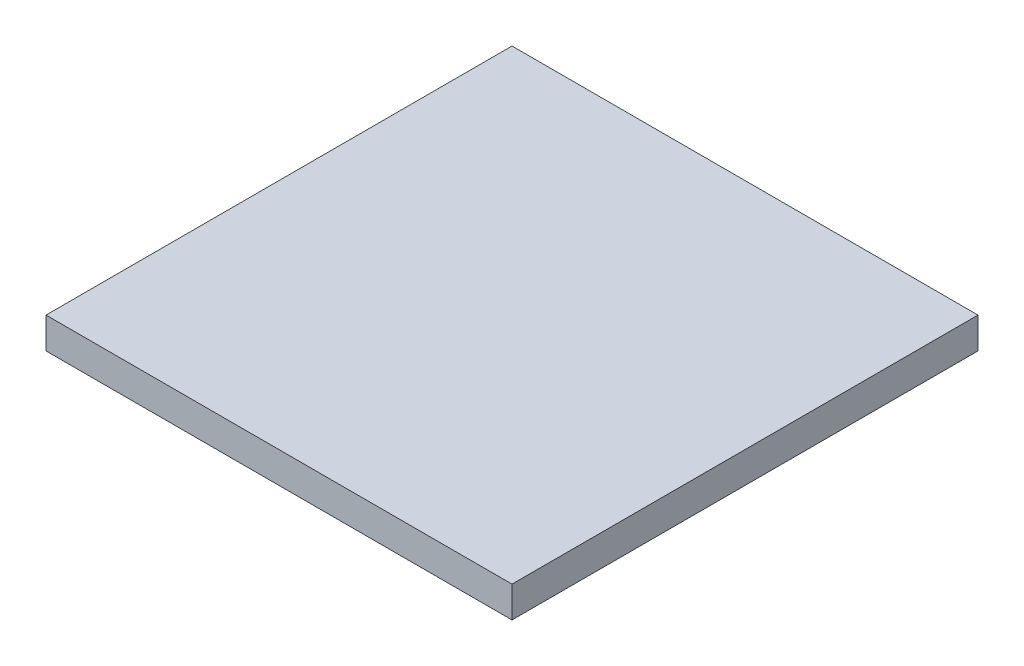
ISO-10303-21;
HEADER;
FILE_DESCRIPTION(('STEP AP214'),'2;1');
FILE_NAME('part.step','',(''),(''),'','','');
FILE_SCHEMA(('AUTOMOTIVE_DESIGN { 1 0 10303 214 1 1 1 1 }'));
ENDSEC;
DATA;
#1=APPLICATION_CONTEXT('core data for automotive mechanical design processes');
#2=APPLICATION_PROTOCOL_DEFINITION('international standard','automotive_design',2000,#1);
#3=PRODUCT_CONTEXT('',#1,'mechanical');
#4=PRODUCT('Part','Part','',(#3));
#5=PRODUCT_RELATED_PRODUCT_CATEGORY('part','',(#4));
#6=PRODUCT_DEFINITION_FORMATION('','',#4);
#7=PRODUCT_DEFINITION_CONTEXT('part definition',#1,'design');
#8=PRODUCT_DEFINITION('design','',#6,#7);
#9=PRODUCT_DEFINITION_SHAPE('','',#8);
#10=(LENGTH_UNIT() NAMED_UNIT(*) SI_UNIT(.MILLI.,.METRE.));
#11=(NAMED_UNIT(*) PLANE_ANGLE_UNIT() SI_UNIT($,.RADIAN.));
#12=(NAMED_UNIT(*) SI_UNIT($,.STERADIAN.) SOLID_ANGLE_UNIT());
#13=UNCERTAINTY_MEASURE_WITH_UNIT(LENGTH_MEASURE(1.E-05),#10,'distance_accuracy_value','');
#14=(GEOMETRIC_REPRESENTATION_CONTEXT(3) GLOBAL_UNCERTAINTY_ASSIGNED_CONTEXT((#13)) GLOBAL_UNIT_ASSIGNED_CONTEXT((#10,
#11,#12)) REPRESENTATION_CONTEXT('',''));
#15=CARTESIAN_POINT('',(0.,0.,0.));
#16=DIRECTION('',(0.,0.,1.));
#17=DIRECTION('',(1.,0.,0.));
#18=AXIS2_PLACEMENT_3D('',#15,#16,#17);
#19=CARTESIAN_POINT('',(0.,0.,0.));
#20=DIRECTION('',(0.,1.,0.));
#21=DIRECTION('',(0.,0.,1.));
#22=AXIS2_PLACEMENT_3D('',#19,#20,#21);
#23=PLANE('',#22);
#24=DIRECTION('',(-1.,0.,0.));
#25=VECTOR('',#24,1.);
#26=CARTESIAN_POINT('',(-7.5,0.,7.5));
#27=LINE('',#26,#25);
#28=CARTESIAN_POINT('',(7.5,0.,7.5));
#29=VERTEX_POINT('',#28);
#30=CARTESIAN_POINT('',(-7.5,0.,7.5));
#31=VERTEX_POINT('',#30);
#32=EDGE_CURVE('E81',#29,#31,#27,.T.);
#33=ORIENTED_EDGE('',*,*,#32,.T.);
#34=DIRECTION('',(0.,0.,-1.));
#35=VECTOR('',#34,1.);
#36=CARTESIAN_POINT('',(-7.5,0.,-7.5));
#37=LINE('',#36,#35);
#38=CARTESIAN_POINT('',(-7.5,0.,-7.5));
#39=VERTEX_POINT('',#38);
#40=EDGE_CURVE('E68',#31,#39,#37,.T.);
#41=ORIENTED_EDGE('',*,*,#40,.T.);
#42=DIRECTION('',(1.,0.,0.));
#43=VECTOR('',#42,1.);
#44=CARTESIAN_POINT('',(-7.5,0.,-7.5));
#45=LINE('',#44,#43);
#46=CARTESIAN_POINT('',(7.5,0.,-7.5));
#47=VERTEX_POINT('',#46);
#48=EDGE_CURVE('E55',#39,#47,#45,.T.);
#49=ORIENTED_EDGE('',*,*,#48,.T.);
#50=DIRECTION('',(0.,0.,1.));
#51=VECTOR('',#50,1.);
#52=CARTESIAN_POINT('',(7.5,0.,-7.5));
#53=LINE('',#52,#51);
#54=EDGE_CURVE('E20',#47,#29,#53,.T.);
#55=ORIENTED_EDGE('',*,*,#54,.T.);
#56=EDGE_LOOP('',(#33,#41,#49,#55));
#57=FACE_BOUND('',#56,.T.);
#58=ADVANCED_FACE('F17',(#57),#23,.F.);
#59=CARTESIAN_POINT('',(7.5,1.,-7.5));
#60=DIRECTION('',(-1.,0.,0.));
#61=DIRECTION('',(0.,0.,1.));
#62=AXIS2_PLACEMENT_3D('',#59,#60,#61);
#63=PLANE('',#62);
#64=DIRECTION('',(0.,1.,0.));
#65=VECTOR('',#64,1.);
#66=CARTESIAN_POINT('',(7.5,1.,-7.5));
#67=LINE('',#66,#65);
#68=CARTESIAN_POINT('',(7.5,1.,-7.5));
#69=VERTEX_POINT('',#68);
#70=EDGE_CURVE('E61',#47,#69,#67,.T.);
#71=ORIENTED_EDGE('',*,*,#70,.T.);
#72=DIRECTION('',(0.,0.,1.));
#73=VECTOR('',#72,1.);
#74=CARTESIAN_POINT('',(7.5,1.,0.));
#75=LINE('',#74,#73);
#76=CARTESIAN_POINT('',(7.5,1.,7.5));
#77=VERTEX_POINT('',#76);
#78=EDGE_CURVE('E83',#77,#69,#75,.F.);
#79=ORIENTED_EDGE('',*,*,#78,.F.);
#80=DIRECTION('',(0.,1.,0.));
#81=VECTOR('',#80,1.);
#82=CARTESIAN_POINT('',(7.5,1.,7.5));
#83=LINE('',#82,#81);
#84=EDGE_CURVE('E64',#77,#29,#83,.F.);
#85=ORIENTED_EDGE('',*,*,#84,.T.);
#86=ORIENTED_EDGE('',*,*,#54,.F.);
#87=EDGE_LOOP('',(#71,#79,#85,#86));
#88=FACE_BOUND('',#87,.T.);
#89=ADVANCED_FACE('F60',(#88),#63,.F.);
#90=CARTESIAN_POINT('',(-7.5,1.,-7.5));
#91=DIRECTION('',(0.,0.,1.));
#92=DIRECTION('',(1.,0.,0.));
#93=AXIS2_PLACEMENT_3D('',#90,#91,#92);
#94=PLANE('',#93);
#95=DIRECTION('',(0.,1.,0.));
#96=VECTOR('',#95,1.);
#97=CARTESIAN_POINT('',(-7.5,1.,-7.5));
#98=LINE('',#97,#96);
#99=CARTESIAN_POINT('',(-7.5,1.,-7.5));
#100=VERTEX_POINT('',#99);
#101=EDGE_CURVE('E70',#39,#100,#98,.T.);
#102=ORIENTED_EDGE('',*,*,#101,.T.);
#103=DIRECTION('',(1.,0.,0.));
#104=VECTOR('',#103,1.);
#105=CARTESIAN_POINT('',(0.,1.,-7.5));
#106=LINE('',#105,#104);
#107=EDGE_CURVE('E74',#69,#100,#106,.F.);
#108=ORIENTED_EDGE('',*,*,#107,.F.);
#109=ORIENTED_EDGE('',*,*,#70,.F.);
#110=ORIENTED_EDGE('',*,*,#48,.F.);
#111=EDGE_LOOP('',(#102,#108,#109,#110));
#112=FACE_BOUND('',#111,.T.);
#113=ADVANCED_FACE('F72',(#112),#94,.F.);
#114=CARTESIAN_POINT('',(-7.5,1.,-7.5));
#115=DIRECTION('',(1.,0.,0.));
#116=DIRECTION('',(0.,0.,-1.));
#117=AXIS2_PLACEMENT_3D('',#114,#115,#116);
#118=PLANE('',#117);
#119=DIRECTION('',(0.,1.,0.));
#120=VECTOR('',#119,1.);
#121=CARTESIAN_POINT('',(-7.5,1.,7.5));
#122=LINE('',#121,#120);
#123=CARTESIAN_POINT('',(-7.5,1.,7.5));
#124=VERTEX_POINT('',#123);
#125=EDGE_CURVE('E35',#31,#124,#122,.T.);
#126=ORIENTED_EDGE('',*,*,#125,.T.);
#127=DIRECTION('',(0.,0.,1.));
#128=VECTOR('',#127,1.);
#129=CARTESIAN_POINT('',(-7.5,1.,0.));
#130=LINE('',#129,#128);
#131=EDGE_CURVE('E26',#100,#124,#130,.T.);
#132=ORIENTED_EDGE('',*,*,#131,.F.);
#133=ORIENTED_EDGE('',*,*,#101,.F.);
#134=ORIENTED_EDGE('',*,*,#40,.F.);
#135=EDGE_LOOP('',(#126,#132,#133,#134));
#136=FACE_BOUND('',#135,.T.);
#137=ADVANCED_FACE('F89',(#136),#118,.F.);
#138=CARTESIAN_POINT('',(-7.5,1.,7.5));
#139=DIRECTION('',(0.,0.,-1.));
#140=DIRECTION('',(-1.,0.,0.));
#141=AXIS2_PLACEMENT_3D('',#138,#139,#140);
#142=PLANE('',#141);
#143=ORIENTED_EDGE('',*,*,#84,.F.);
#144=DIRECTION('',(1.,0.,0.));
#145=VECTOR('',#144,1.);
#146=CARTESIAN_POINT('',(0.,1.,7.5));
#147=LINE('',#146,#145);
#148=EDGE_CURVE('E11',#124,#77,#147,.T.);
#149=ORIENTED_EDGE('',*,*,#148,.F.);
#150=ORIENTED_EDGE('',*,*,#125,.F.);
#151=ORIENTED_EDGE('',*,*,#32,.F.);
#152=EDGE_LOOP('',(#143,#149,#150,#151));
#153=FACE_BOUND('',#152,.T.);
#154=ADVANCED_FACE('F91',(#153),#142,.F.);
#155=CARTESIAN_POINT('',(0.,1.,0.));
#156=DIRECTION('',(0.,1.,0.));
#157=DIRECTION('',(0.,0.,1.));
#158=AXIS2_PLACEMENT_3D('',#155,#156,#157);
#159=PLANE('',#158);
#160=ORIENTED_EDGE('',*,*,#131,.T.);
#161=ORIENTED_EDGE('',*,*,#148,.T.);
#162=ORIENTED_EDGE('',*,*,#78,.T.);
#163=ORIENTED_EDGE('',*,*,#107,.T.);
#164=EDGE_LOOP('',(#160,#161,#162,#163));
#165=FACE_BOUND('',#164,.T.);
#166=ADVANCED_FACE('F88',(#165),#159,.T.);
#167=CLOSED_SHELL('',(#58,#89,#113,#137,#154,#166));
#168=MANIFOLD_SOLID_BREP('B1',#167);
#169=ADVANCED_BREP_SHAPE_REPRESENTATION('',(#18,#168),#14);
#170=SHAPE_DEFINITION_REPRESENTATION(#9,#169);
ENDSEC;
END-ISO-10303-21;
